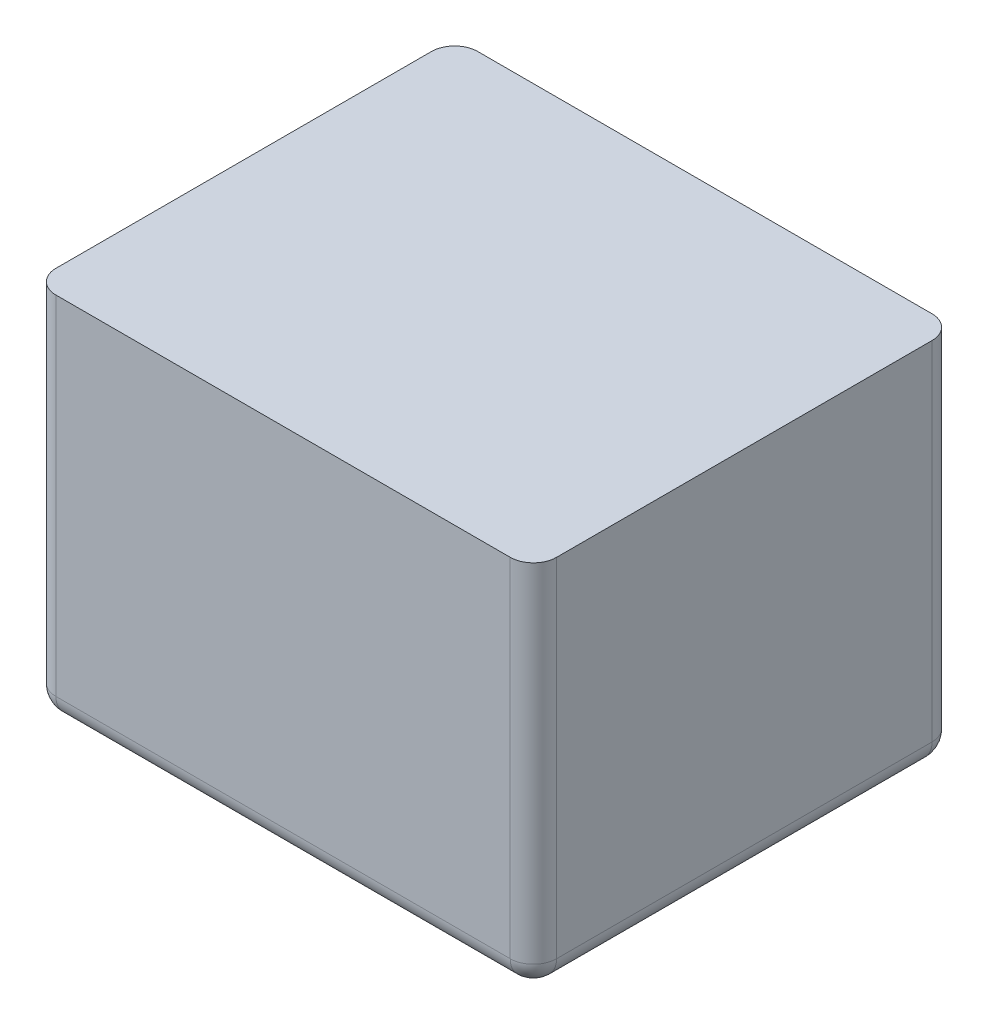
ISO-10303-21;
HEADER;
FILE_DESCRIPTION(('STEP AP214'),'2;1');
FILE_NAME('part.step','',(''),(''),'','','');
FILE_SCHEMA(('AUTOMOTIVE_DESIGN { 1 0 10303 214 1 1 1 1 }'));
ENDSEC;
DATA;
#1=APPLICATION_CONTEXT('core data for automotive mechanical design processes');
#2=APPLICATION_PROTOCOL_DEFINITION('international standard','automotive_design',2000,#1);
#3=PRODUCT_CONTEXT('',#1,'mechanical');
#4=PRODUCT('Part','Part','',(#3));
#5=PRODUCT_RELATED_PRODUCT_CATEGORY('part','',(#4));
#6=PRODUCT_DEFINITION_FORMATION('','',#4);
#7=PRODUCT_DEFINITION_CONTEXT('part definition',#1,'design');
#8=PRODUCT_DEFINITION('design','',#6,#7);
#9=PRODUCT_DEFINITION_SHAPE('','',#8);
#10=(LENGTH_UNIT() NAMED_UNIT(*) SI_UNIT(.MILLI.,.METRE.));
#11=(NAMED_UNIT(*) PLANE_ANGLE_UNIT() SI_UNIT($,.RADIAN.));
#12=(NAMED_UNIT(*) SI_UNIT($,.STERADIAN.) SOLID_ANGLE_UNIT());
#13=UNCERTAINTY_MEASURE_WITH_UNIT(LENGTH_MEASURE(1.E-05),#10,'distance_accuracy_value','');
#14=(GEOMETRIC_REPRESENTATION_CONTEXT(3) GLOBAL_UNCERTAINTY_ASSIGNED_CONTEXT((#13)) GLOBAL_UNIT_ASSIGNED_CONTEXT((#10,
#11,#12)) REPRESENTATION_CONTEXT('',''));
#15=CARTESIAN_POINT('',(0.,0.,0.));
#16=DIRECTION('',(0.,0.,1.));
#17=DIRECTION('',(1.,0.,0.));
#18=AXIS2_PLACEMENT_3D('',#15,#16,#17);
#19=CARTESIAN_POINT('',(16.2,24.,13.65));
#20=DIRECTION('',(-1.,0.,0.));
#21=DIRECTION('',(0.,0.,1.));
#22=AXIS2_PLACEMENT_3D('',#19,#20,#21);
#23=PLANE('',#22);
#24=DIRECTION('',(0.,0.,-1.));
#25=VECTOR('',#24,1.);
#26=CARTESIAN_POINT('',(16.2,1.5,-13.65));
#27=LINE('',#26,#25);
#28=CARTESIAN_POINT('',(16.2,1.5,12.15));
#29=VERTEX_POINT('',#28);
#30=CARTESIAN_POINT('',(16.2,1.5,-12.15));
#31=VERTEX_POINT('',#30);
#32=EDGE_CURVE('E57',#29,#31,#27,.T.);
#33=ORIENTED_EDGE('',*,*,#32,.T.);
#34=DIRECTION('',(0.,-1.,0.));
#35=VECTOR('',#34,1.);
#36=CARTESIAN_POINT('',(16.2,24.,-12.15));
#37=LINE('',#36,#35);
#38=CARTESIAN_POINT('',(16.2,24.,-12.15));
#39=VERTEX_POINT('',#38);
#40=EDGE_CURVE('E185',#31,#39,#37,.F.);
#41=ORIENTED_EDGE('',*,*,#40,.T.);
#42=DIRECTION('',(0.,0.,-1.));
#43=VECTOR('',#42,1.);
#44=CARTESIAN_POINT('',(16.2,24.,13.65));
#45=LINE('',#44,#43);
#46=CARTESIAN_POINT('',(16.2,24.,12.15));
#47=VERTEX_POINT('',#46);
#48=EDGE_CURVE('E128',#47,#39,#45,.T.);
#49=ORIENTED_EDGE('',*,*,#48,.F.);
#50=DIRECTION('',(0.,-1.,0.));
#51=VECTOR('',#50,1.);
#52=CARTESIAN_POINT('',(16.2,24.,12.15));
#53=LINE('',#52,#51);
#54=EDGE_CURVE('E65',#47,#29,#53,.T.);
#55=ORIENTED_EDGE('',*,*,#54,.T.);
#56=EDGE_LOOP('',(#33,#41,#49,#55));
#57=FACE_BOUND('',#56,.T.);
#58=ADVANCED_FACE('F40',(#57),#23,.F.);
#59=CARTESIAN_POINT('',(-16.2,24.,-13.65));
#60=DIRECTION('',(0.,0.,1.));
#61=DIRECTION('',(1.,0.,0.));
#62=AXIS2_PLACEMENT_3D('',#59,#60,#61);
#63=PLANE('',#62);
#64=DIRECTION('',(-1.,0.,0.));
#65=VECTOR('',#64,1.);
#66=CARTESIAN_POINT('',(-16.2,24.,-13.65));
#67=LINE('',#66,#65);
#68=CARTESIAN_POINT('',(14.7,24.,-13.65));
#69=VERTEX_POINT('',#68);
#70=CARTESIAN_POINT('',(-14.7,24.,-13.65));
#71=VERTEX_POINT('',#70);
#72=EDGE_CURVE('E126',#69,#71,#67,.T.);
#73=ORIENTED_EDGE('',*,*,#72,.F.);
#74=DIRECTION('',(0.,-1.,0.));
#75=VECTOR('',#74,1.);
#76=CARTESIAN_POINT('',(14.7,24.,-13.65));
#77=LINE('',#76,#75);
#78=CARTESIAN_POINT('',(14.7,1.5,-13.65));
#79=VERTEX_POINT('',#78);
#80=EDGE_CURVE('E134',#69,#79,#77,.T.);
#81=ORIENTED_EDGE('',*,*,#80,.T.);
#82=DIRECTION('',(-1.,0.,0.));
#83=VECTOR('',#82,1.);
#84=CARTESIAN_POINT('',(-16.2,1.5,-13.65));
#85=LINE('',#84,#83);
#86=CARTESIAN_POINT('',(-14.7,1.5,-13.65));
#87=VERTEX_POINT('',#86);
#88=EDGE_CURVE('E147',#79,#87,#85,.T.);
#89=ORIENTED_EDGE('',*,*,#88,.T.);
#90=DIRECTION('',(0.,-1.,0.));
#91=VECTOR('',#90,1.);
#92=CARTESIAN_POINT('',(-14.7,24.,-13.65));
#93=LINE('',#92,#91);
#94=EDGE_CURVE('E137',#87,#71,#93,.F.);
#95=ORIENTED_EDGE('',*,*,#94,.T.);
#96=EDGE_LOOP('',(#73,#81,#89,#95));
#97=FACE_BOUND('',#96,.T.);
#98=ADVANCED_FACE('F132',(#97),#63,.F.);
#99=CARTESIAN_POINT('',(-16.2,24.,13.65));
#100=DIRECTION('',(1.,0.,0.));
#101=DIRECTION('',(0.,0.,-1.));
#102=AXIS2_PLACEMENT_3D('',#99,#100,#101);
#103=PLANE('',#102);
#104=DIRECTION('',(0.,0.,1.));
#105=VECTOR('',#104,1.);
#106=CARTESIAN_POINT('',(-16.2,24.,13.65));
#107=LINE('',#106,#105);
#108=CARTESIAN_POINT('',(-16.2,24.,-12.15));
#109=VERTEX_POINT('',#108);
#110=CARTESIAN_POINT('',(-16.2,24.,12.15));
#111=VERTEX_POINT('',#110);
#112=EDGE_CURVE('E139',#109,#111,#107,.T.);
#113=ORIENTED_EDGE('',*,*,#112,.F.);
#114=DIRECTION('',(0.,-1.,0.));
#115=VECTOR('',#114,1.);
#116=CARTESIAN_POINT('',(-16.2,24.,-12.15));
#117=LINE('',#116,#115);
#118=CARTESIAN_POINT('',(-16.2,1.5,-12.15));
#119=VERTEX_POINT('',#118);
#120=EDGE_CURVE('E170',#109,#119,#117,.T.);
#121=ORIENTED_EDGE('',*,*,#120,.T.);
#122=DIRECTION('',(0.,0.,1.));
#123=VECTOR('',#122,1.);
#124=CARTESIAN_POINT('',(-16.2,1.5,13.65));
#125=LINE('',#124,#123);
#126=CARTESIAN_POINT('',(-16.2,1.5,12.15));
#127=VERTEX_POINT('',#126);
#128=EDGE_CURVE('E168',#119,#127,#125,.T.);
#129=ORIENTED_EDGE('',*,*,#128,.T.);
#130=DIRECTION('',(0.,-1.,0.));
#131=VECTOR('',#130,1.);
#132=CARTESIAN_POINT('',(-16.2,24.,12.15));
#133=LINE('',#132,#131);
#134=EDGE_CURVE('E165',#127,#111,#133,.F.);
#135=ORIENTED_EDGE('',*,*,#134,.T.);
#136=EDGE_LOOP('',(#113,#121,#129,#135));
#137=FACE_BOUND('',#136,.T.);
#138=ADVANCED_FACE('F265',(#137),#103,.F.);
#139=CARTESIAN_POINT('',(-16.2,24.,13.65));
#140=DIRECTION('',(0.,0.,-1.));
#141=DIRECTION('',(-1.,0.,0.));
#142=AXIS2_PLACEMENT_3D('',#139,#140,#141);
#143=PLANE('',#142);
#144=DIRECTION('',(1.,0.,0.));
#145=VECTOR('',#144,1.);
#146=CARTESIAN_POINT('',(-16.2,24.,13.65));
#147=LINE('',#146,#145);
#148=CARTESIAN_POINT('',(-14.7,24.,13.65));
#149=VERTEX_POINT('',#148);
#150=CARTESIAN_POINT('',(14.7,24.,13.65));
#151=VERTEX_POINT('',#150);
#152=EDGE_CURVE('E234',#149,#151,#147,.T.);
#153=ORIENTED_EDGE('',*,*,#152,.F.);
#154=DIRECTION('',(0.,-1.,0.));
#155=VECTOR('',#154,1.);
#156=CARTESIAN_POINT('',(-14.7,24.,13.65));
#157=LINE('',#156,#155);
#158=CARTESIAN_POINT('',(-14.7,1.5,13.65));
#159=VERTEX_POINT('',#158);
#160=EDGE_CURVE('E178',#149,#159,#157,.T.);
#161=ORIENTED_EDGE('',*,*,#160,.T.);
#162=DIRECTION('',(1.,0.,0.));
#163=VECTOR('',#162,1.);
#164=CARTESIAN_POINT('',(16.2,1.5,13.65));
#165=LINE('',#164,#163);
#166=CARTESIAN_POINT('',(14.7,1.5,13.65));
#167=VERTEX_POINT('',#166);
#168=EDGE_CURVE('E175',#159,#167,#165,.T.);
#169=ORIENTED_EDGE('',*,*,#168,.T.);
#170=DIRECTION('',(0.,-1.,0.));
#171=VECTOR('',#170,1.);
#172=CARTESIAN_POINT('',(14.7,24.,13.65));
#173=LINE('',#172,#171);
#174=EDGE_CURVE('E172',#167,#151,#173,.F.);
#175=ORIENTED_EDGE('',*,*,#174,.T.);
#176=EDGE_LOOP('',(#153,#161,#169,#175));
#177=FACE_BOUND('',#176,.T.);
#178=ADVANCED_FACE('F284',(#177),#143,.F.);
#179=CARTESIAN_POINT('',(0.,24.,0.));
#180=DIRECTION('',(0.,-1.,0.));
#181=DIRECTION('',(0.,0.,-1.));
#182=AXIS2_PLACEMENT_3D('',#179,#180,#181);
#183=PLANE('',#182);
#184=ORIENTED_EDGE('',*,*,#48,.T.);
#185=CARTESIAN_POINT('',(14.7,24.,-12.15));
#186=DIRECTION('',(0.,-1.,0.));
#187=DIRECTION('',(0.,0.,-1.));
#188=AXIS2_PLACEMENT_3D('',#185,#186,#187);
#189=CIRCLE('',#188,1.5);
#190=EDGE_CURVE('E11',#39,#69,#189,.F.);
#191=ORIENTED_EDGE('',*,*,#190,.T.);
#192=ORIENTED_EDGE('',*,*,#72,.T.);
#193=CARTESIAN_POINT('',(-14.7,24.,-12.15));
#194=DIRECTION('',(0.,-1.,0.));
#195=DIRECTION('',(0.,0.,-1.));
#196=AXIS2_PLACEMENT_3D('',#193,#194,#195);
#197=CIRCLE('',#196,1.5);
#198=EDGE_CURVE('E49',#71,#109,#197,.F.);
#199=ORIENTED_EDGE('',*,*,#198,.T.);
#200=ORIENTED_EDGE('',*,*,#112,.T.);
#201=CARTESIAN_POINT('',(-14.7,24.,12.15));
#202=DIRECTION('',(0.,-1.,0.));
#203=DIRECTION('',(0.,0.,-1.));
#204=AXIS2_PLACEMENT_3D('',#201,#202,#203);
#205=CIRCLE('',#204,1.5);
#206=EDGE_CURVE('E190',#111,#149,#205,.F.);
#207=ORIENTED_EDGE('',*,*,#206,.T.);
#208=ORIENTED_EDGE('',*,*,#152,.T.);
#209=CARTESIAN_POINT('',(14.7,24.,12.15));
#210=DIRECTION('',(0.,-1.,0.));
#211=DIRECTION('',(0.,0.,-1.));
#212=AXIS2_PLACEMENT_3D('',#209,#210,#211);
#213=CIRCLE('',#212,1.5);
#214=EDGE_CURVE('E188',#151,#47,#213,.F.);
#215=ORIENTED_EDGE('',*,*,#214,.T.);
#216=EDGE_LOOP('',(#184,#191,#192,#199,#200,#207,#208,#215));
#217=FACE_BOUND('',#216,.T.);
#218=ADVANCED_FACE('F125',(#217),#183,.F.);
#219=CARTESIAN_POINT('',(0.,0.,0.));
#220=DIRECTION('',(0.,-1.,0.));
#221=DIRECTION('',(0.,0.,-1.));
#222=AXIS2_PLACEMENT_3D('',#219,#220,#221);
#223=PLANE('',#222);
#224=DIRECTION('',(0.,0.,1.));
#225=VECTOR('',#224,1.);
#226=CARTESIAN_POINT('',(-14.7,0.,-13.65));
#227=LINE('',#226,#225);
#228=CARTESIAN_POINT('',(-14.7,0.,12.15));
#229=VERTEX_POINT('',#228);
#230=CARTESIAN_POINT('',(-14.7,0.,-12.15));
#231=VERTEX_POINT('',#230);
#232=EDGE_CURVE('E159',#229,#231,#227,.F.);
#233=ORIENTED_EDGE('',*,*,#232,.T.);
#234=DIRECTION('',(-1.,0.,0.));
#235=VECTOR('',#234,1.);
#236=CARTESIAN_POINT('',(16.2,0.,-12.15));
#237=LINE('',#236,#235);
#238=CARTESIAN_POINT('',(14.7,0.,-12.15));
#239=VERTEX_POINT('',#238);
#240=EDGE_CURVE('E161',#231,#239,#237,.F.);
#241=ORIENTED_EDGE('',*,*,#240,.T.);
#242=DIRECTION('',(0.,0.,-1.));
#243=VECTOR('',#242,1.);
#244=CARTESIAN_POINT('',(14.7,0.,13.65));
#245=LINE('',#244,#243);
#246=CARTESIAN_POINT('',(14.7,0.,12.15));
#247=VERTEX_POINT('',#246);
#248=EDGE_CURVE('E146',#239,#247,#245,.F.);
#249=ORIENTED_EDGE('',*,*,#248,.T.);
#250=DIRECTION('',(1.,0.,0.));
#251=VECTOR('',#250,1.);
#252=CARTESIAN_POINT('',(-16.2,0.,12.15));
#253=LINE('',#252,#251);
#254=EDGE_CURVE('E151',#247,#229,#253,.F.);
#255=ORIENTED_EDGE('',*,*,#254,.T.);
#256=EDGE_LOOP('',(#233,#241,#249,#255));
#257=FACE_BOUND('',#256,.T.);
#258=ADVANCED_FACE('F279',(#257),#223,.T.);
#259=CARTESIAN_POINT('',(14.7,24.,12.15));
#260=DIRECTION('',(0.,-1.,0.));
#261=DIRECTION('',(0.,0.,-1.));
#262=AXIS2_PLACEMENT_3D('',#259,#260,#261);
#263=CYLINDRICAL_SURFACE('',#262,1.5);
#264=ORIENTED_EDGE('',*,*,#214,.F.);
#265=ORIENTED_EDGE('',*,*,#174,.F.);
#266=CARTESIAN_POINT('',(14.7,1.5,12.15));
#267=DIRECTION('',(0.,-1.,0.));
#268=DIRECTION('',(0.,0.,-1.));
#269=AXIS2_PLACEMENT_3D('',#266,#267,#268);
#270=CIRCLE('',#269,1.5);
#271=EDGE_CURVE('E222',#29,#167,#270,.T.);
#272=ORIENTED_EDGE('',*,*,#271,.F.);
#273=ORIENTED_EDGE('',*,*,#54,.F.);
#274=EDGE_LOOP('',(#264,#265,#272,#273));
#275=FACE_BOUND('',#274,.T.);
#276=ADVANCED_FACE('F42',(#275),#263,.T.);
#277=CARTESIAN_POINT('',(-14.7,24.,12.15));
#278=DIRECTION('',(0.,-1.,0.));
#279=DIRECTION('',(0.,0.,-1.));
#280=AXIS2_PLACEMENT_3D('',#277,#278,#279);
#281=CYLINDRICAL_SURFACE('',#280,1.5);
#282=ORIENTED_EDGE('',*,*,#206,.F.);
#283=ORIENTED_EDGE('',*,*,#134,.F.);
#284=CARTESIAN_POINT('',(-14.7,1.5,12.15));
#285=DIRECTION('',(0.,-1.,0.));
#286=DIRECTION('',(0.,0.,-1.));
#287=AXIS2_PLACEMENT_3D('',#284,#285,#286);
#288=CIRCLE('',#287,1.5);
#289=EDGE_CURVE('E220',#159,#127,#288,.T.);
#290=ORIENTED_EDGE('',*,*,#289,.F.);
#291=ORIENTED_EDGE('',*,*,#160,.F.);
#292=EDGE_LOOP('',(#282,#283,#290,#291));
#293=FACE_BOUND('',#292,.T.);
#294=ADVANCED_FACE('F270',(#293),#281,.T.);
#295=CARTESIAN_POINT('',(-16.2,1.5,12.15));
#296=DIRECTION('',(-1.,0.,0.));
#297=DIRECTION('',(0.,0.,1.));
#298=AXIS2_PLACEMENT_3D('',#295,#296,#297);
#299=CYLINDRICAL_SURFACE('',#298,1.5);
#300=CARTESIAN_POINT('',(14.7,1.5,12.15));
#301=DIRECTION('',(1.,0.,0.));
#302=DIRECTION('',(0.,0.,-1.));
#303=AXIS2_PLACEMENT_3D('',#300,#301,#302);
#304=CIRCLE('',#303,1.5);
#305=EDGE_CURVE('E44',#167,#247,#304,.T.);
#306=ORIENTED_EDGE('',*,*,#305,.F.);
#307=ORIENTED_EDGE('',*,*,#168,.F.);
#308=CARTESIAN_POINT('',(-14.7,1.5,12.15));
#309=DIRECTION('',(-1.,0.,0.));
#310=DIRECTION('',(0.,0.,1.));
#311=AXIS2_PLACEMENT_3D('',#308,#309,#310);
#312=CIRCLE('',#311,1.5);
#313=EDGE_CURVE('E217',#229,#159,#312,.T.);
#314=ORIENTED_EDGE('',*,*,#313,.F.);
#315=ORIENTED_EDGE('',*,*,#254,.F.);
#316=EDGE_LOOP('',(#306,#307,#314,#315));
#317=FACE_BOUND('',#316,.T.);
#318=ADVANCED_FACE('F283',(#317),#299,.T.);
#319=CARTESIAN_POINT('',(14.7,1.5,12.15));
#320=DIRECTION('',(0.,0.,1.));
#321=DIRECTION('',(1.,0.,0.));
#322=AXIS2_PLACEMENT_3D('',#319,#320,#321);
#323=SPHERICAL_SURFACE('',#322,1.5);
#324=ORIENTED_EDGE('',*,*,#271,.T.);
#325=ORIENTED_EDGE('',*,*,#305,.T.);
#326=CARTESIAN_POINT('',(14.7,1.5,12.15));
#327=DIRECTION('',(0.,0.,1.));
#328=DIRECTION('',(1.,0.,0.));
#329=AXIS2_PLACEMENT_3D('',#326,#327,#328);
#330=CIRCLE('',#329,1.5);
#331=EDGE_CURVE('E213',#29,#247,#330,.F.);
#332=ORIENTED_EDGE('',*,*,#331,.F.);
#333=EDGE_LOOP('',(#324,#325,#332));
#334=FACE_BOUND('',#333,.T.);
#335=ADVANCED_FACE('F244',(#334),#323,.T.);
#336=CARTESIAN_POINT('',(-14.7,1.5,12.15));
#337=DIRECTION('',(0.,0.,1.));
#338=DIRECTION('',(1.,0.,0.));
#339=AXIS2_PLACEMENT_3D('',#336,#337,#338);
#340=SPHERICAL_SURFACE('',#339,1.5);
#341=ORIENTED_EDGE('',*,*,#313,.T.);
#342=ORIENTED_EDGE('',*,*,#289,.T.);
#343=CARTESIAN_POINT('',(-14.7,1.5,12.15));
#344=DIRECTION('',(0.,0.,1.));
#345=DIRECTION('',(1.,0.,0.));
#346=AXIS2_PLACEMENT_3D('',#343,#344,#345);
#347=CIRCLE('',#346,1.5);
#348=EDGE_CURVE('E210',#229,#127,#347,.F.);
#349=ORIENTED_EDGE('',*,*,#348,.F.);
#350=EDGE_LOOP('',(#341,#342,#349));
#351=FACE_BOUND('',#350,.T.);
#352=ADVANCED_FACE('F273',(#351),#340,.T.);
#353=CARTESIAN_POINT('',(14.7,1.5,13.65));
#354=DIRECTION('',(0.,0.,1.));
#355=DIRECTION('',(1.,0.,0.));
#356=AXIS2_PLACEMENT_3D('',#353,#354,#355);
#357=CYLINDRICAL_SURFACE('',#356,1.5);
#358=ORIENTED_EDGE('',*,*,#331,.T.);
#359=ORIENTED_EDGE('',*,*,#248,.F.);
#360=CARTESIAN_POINT('',(14.7,1.5,-12.15));
#361=DIRECTION('',(0.,0.,-1.));
#362=DIRECTION('',(-1.,0.,0.));
#363=AXIS2_PLACEMENT_3D('',#360,#361,#362);
#364=CIRCLE('',#363,1.5);
#365=EDGE_CURVE('E206',#31,#239,#364,.T.);
#366=ORIENTED_EDGE('',*,*,#365,.F.);
#367=ORIENTED_EDGE('',*,*,#32,.F.);
#368=EDGE_LOOP('',(#358,#359,#366,#367));
#369=FACE_BOUND('',#368,.T.);
#370=ADVANCED_FACE('F248',(#369),#357,.T.);
#371=CARTESIAN_POINT('',(14.7,24.,-12.15));
#372=DIRECTION('',(0.,-1.,0.));
#373=DIRECTION('',(0.,0.,-1.));
#374=AXIS2_PLACEMENT_3D('',#371,#372,#373);
#375=CYLINDRICAL_SURFACE('',#374,1.5);
#376=ORIENTED_EDGE('',*,*,#190,.F.);
#377=ORIENTED_EDGE('',*,*,#40,.F.);
#378=CARTESIAN_POINT('',(14.7,1.5,-12.15));
#379=DIRECTION('',(0.,-1.,0.));
#380=DIRECTION('',(0.,0.,-1.));
#381=AXIS2_PLACEMENT_3D('',#378,#379,#380);
#382=CIRCLE('',#381,1.5);
#383=EDGE_CURVE('E143',#79,#31,#382,.T.);
#384=ORIENTED_EDGE('',*,*,#383,.F.);
#385=ORIENTED_EDGE('',*,*,#80,.F.);
#386=EDGE_LOOP('',(#376,#377,#384,#385));
#387=FACE_BOUND('',#386,.T.);
#388=ADVANCED_FACE('F141',(#387),#375,.T.);
#389=CARTESIAN_POINT('',(-14.7,24.,-12.15));
#390=DIRECTION('',(0.,-1.,0.));
#391=DIRECTION('',(0.,0.,-1.));
#392=AXIS2_PLACEMENT_3D('',#389,#390,#391);
#393=CYLINDRICAL_SURFACE('',#392,1.5);
#394=ORIENTED_EDGE('',*,*,#198,.F.);
#395=ORIENTED_EDGE('',*,*,#94,.F.);
#396=CARTESIAN_POINT('',(-14.7,1.5,-12.15));
#397=DIRECTION('',(0.,-1.,0.));
#398=DIRECTION('',(0.,0.,-1.));
#399=AXIS2_PLACEMENT_3D('',#396,#397,#398);
#400=CIRCLE('',#399,1.5);
#401=EDGE_CURVE('E201',#119,#87,#400,.T.);
#402=ORIENTED_EDGE('',*,*,#401,.F.);
#403=ORIENTED_EDGE('',*,*,#120,.F.);
#404=EDGE_LOOP('',(#394,#395,#402,#403));
#405=FACE_BOUND('',#404,.T.);
#406=ADVANCED_FACE('F262',(#405),#393,.T.);
#407=CARTESIAN_POINT('',(-14.7,1.5,13.65));
#408=DIRECTION('',(0.,0.,-1.));
#409=DIRECTION('',(-1.,0.,0.));
#410=AXIS2_PLACEMENT_3D('',#407,#408,#409);
#411=CYLINDRICAL_SURFACE('',#410,1.5);
#412=ORIENTED_EDGE('',*,*,#348,.T.);
#413=ORIENTED_EDGE('',*,*,#128,.F.);
#414=CARTESIAN_POINT('',(-14.7,1.5,-12.15));
#415=DIRECTION('',(0.,0.,-1.));
#416=DIRECTION('',(-1.,0.,0.));
#417=AXIS2_PLACEMENT_3D('',#414,#415,#416);
#418=CIRCLE('',#417,1.5);
#419=EDGE_CURVE('E198',#231,#119,#418,.T.);
#420=ORIENTED_EDGE('',*,*,#419,.F.);
#421=ORIENTED_EDGE('',*,*,#232,.F.);
#422=EDGE_LOOP('',(#412,#413,#420,#421));
#423=FACE_BOUND('',#422,.T.);
#424=ADVANCED_FACE('F277',(#423),#411,.T.);
#425=CARTESIAN_POINT('',(14.7,1.5,-12.15));
#426=DIRECTION('',(0.,0.,1.));
#427=DIRECTION('',(1.,0.,0.));
#428=AXIS2_PLACEMENT_3D('',#425,#426,#427);
#429=SPHERICAL_SURFACE('',#428,1.5);
#430=ORIENTED_EDGE('',*,*,#383,.T.);
#431=ORIENTED_EDGE('',*,*,#365,.T.);
#432=CARTESIAN_POINT('',(14.7,1.5,-12.15));
#433=DIRECTION('',(1.,0.,0.));
#434=DIRECTION('',(0.,0.,-1.));
#435=AXIS2_PLACEMENT_3D('',#432,#433,#434);
#436=CIRCLE('',#435,1.5);
#437=EDGE_CURVE('E195',#79,#239,#436,.F.);
#438=ORIENTED_EDGE('',*,*,#437,.F.);
#439=EDGE_LOOP('',(#430,#431,#438));
#440=FACE_BOUND('',#439,.T.);
#441=ADVANCED_FACE('F250',(#440),#429,.T.);
#442=CARTESIAN_POINT('',(-14.7,1.5,-12.15));
#443=DIRECTION('',(0.,0.,1.));
#444=DIRECTION('',(1.,0.,0.));
#445=AXIS2_PLACEMENT_3D('',#442,#443,#444);
#446=SPHERICAL_SURFACE('',#445,1.5);
#447=ORIENTED_EDGE('',*,*,#419,.T.);
#448=ORIENTED_EDGE('',*,*,#401,.T.);
#449=CARTESIAN_POINT('',(-14.7,1.5,-12.15));
#450=DIRECTION('',(-1.,0.,0.));
#451=DIRECTION('',(0.,0.,1.));
#452=AXIS2_PLACEMENT_3D('',#449,#450,#451);
#453=CIRCLE('',#452,1.5);
#454=EDGE_CURVE('E193',#231,#87,#453,.F.);
#455=ORIENTED_EDGE('',*,*,#454,.F.);
#456=EDGE_LOOP('',(#447,#448,#455));
#457=FACE_BOUND('',#456,.T.);
#458=ADVANCED_FACE('F258',(#457),#446,.T.);
#459=CARTESIAN_POINT('',(-16.2,1.5,-12.15));
#460=DIRECTION('',(1.,0.,0.));
#461=DIRECTION('',(0.,0.,-1.));
#462=AXIS2_PLACEMENT_3D('',#459,#460,#461);
#463=CYLINDRICAL_SURFACE('',#462,1.5);
#464=ORIENTED_EDGE('',*,*,#437,.T.);
#465=ORIENTED_EDGE('',*,*,#240,.F.);
#466=ORIENTED_EDGE('',*,*,#454,.T.);
#467=ORIENTED_EDGE('',*,*,#88,.F.);
#468=EDGE_LOOP('',(#464,#465,#466,#467));
#469=FACE_BOUND('',#468,.T.);
#470=ADVANCED_FACE('F254',(#469),#463,.T.);
#471=CLOSED_SHELL('',(#58,#98,#138,#178,#218,#258,#276,#294,#318,#335,#352,#370,#388,#406,#424,
#441,#458,#470));
#472=MANIFOLD_SOLID_BREP('B2',#471);
#473=ADVANCED_BREP_SHAPE_REPRESENTATION('',(#18,#472),#14);
#474=SHAPE_DEFINITION_REPRESENTATION(#9,#473);
ENDSEC;
END-ISO-10303-21;
